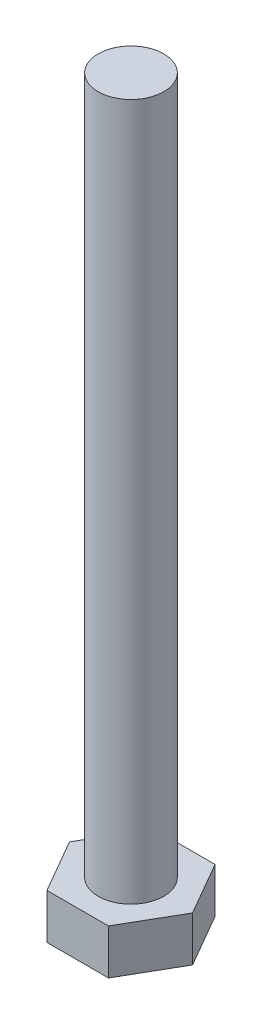
ISO-10303-21;
HEADER;
FILE_DESCRIPTION(('STEP AP214'),'2;1');
FILE_NAME('part.step','',(''),(''),'','','');
FILE_SCHEMA(('AUTOMOTIVE_DESIGN { 1 0 10303 214 1 1 1 1 }'));
ENDSEC;
DATA;
#1=APPLICATION_CONTEXT('core data for automotive mechanical design processes');
#2=APPLICATION_PROTOCOL_DEFINITION('international standard','automotive_design',2000,#1);
#3=PRODUCT_CONTEXT('',#1,'mechanical');
#4=PRODUCT('Part','Part','',(#3));
#5=PRODUCT_RELATED_PRODUCT_CATEGORY('part','',(#4));
#6=PRODUCT_DEFINITION_FORMATION('','',#4);
#7=PRODUCT_DEFINITION_CONTEXT('part definition',#1,'design');
#8=PRODUCT_DEFINITION('design','',#6,#7);
#9=PRODUCT_DEFINITION_SHAPE('','',#8);
#10=(LENGTH_UNIT() NAMED_UNIT(*) SI_UNIT(.MILLI.,.METRE.));
#11=(NAMED_UNIT(*) PLANE_ANGLE_UNIT() SI_UNIT($,.RADIAN.));
#12=(NAMED_UNIT(*) SI_UNIT($,.STERADIAN.) SOLID_ANGLE_UNIT());
#13=UNCERTAINTY_MEASURE_WITH_UNIT(LENGTH_MEASURE(1.E-05),#10,'distance_accuracy_value','');
#14=(GEOMETRIC_REPRESENTATION_CONTEXT(3) GLOBAL_UNCERTAINTY_ASSIGNED_CONTEXT((#13)) GLOBAL_UNIT_ASSIGNED_CONTEXT((#10,
#11,#12)) REPRESENTATION_CONTEXT('',''));
#15=CARTESIAN_POINT('',(0.,0.,0.));
#16=DIRECTION('',(0.,0.,1.));
#17=DIRECTION('',(1.,0.,0.));
#18=AXIS2_PLACEMENT_3D('',#15,#16,#17);
#19=CARTESIAN_POINT('',(0.,5.5,0.));
#20=DIRECTION('',(0.,1.,0.));
#21=DIRECTION('',(0.,0.,1.));
#22=AXIS2_PLACEMENT_3D('',#19,#20,#21);
#23=PLANE('',#22);
#24=DIRECTION('',(-0.5,0.,0.866025403784439));
#25=VECTOR('',#24,1.);
#26=CARTESIAN_POINT('',(-3.75277674973257,5.5,-6.5));
#27=LINE('',#26,#25);
#28=CARTESIAN_POINT('',(-3.75277674973257,5.5,-6.5));
#29=VERTEX_POINT('',#28);
#30=CARTESIAN_POINT('',(-7.50555349946514,5.5,0.));
#31=VERTEX_POINT('',#30);
#32=EDGE_CURVE('E128',#29,#31,#27,.T.);
#33=ORIENTED_EDGE('',*,*,#32,.T.);
#34=DIRECTION('',(0.5,0.,0.866025403784439));
#35=VECTOR('',#34,1.);
#36=CARTESIAN_POINT('',(-7.50555349946514,5.5,0.));
#37=LINE('',#36,#35);
#38=CARTESIAN_POINT('',(-3.75277674973257,5.5,6.5));
#39=VERTEX_POINT('',#38);
#40=EDGE_CURVE('E86',#31,#39,#37,.T.);
#41=ORIENTED_EDGE('',*,*,#40,.T.);
#42=DIRECTION('',(1.,0.,0.));
#43=VECTOR('',#42,1.);
#44=CARTESIAN_POINT('',(-3.75277674973257,5.5,6.5));
#45=LINE('',#44,#43);
#46=CARTESIAN_POINT('',(3.75277674973257,5.5,6.5));
#47=VERTEX_POINT('',#46);
#48=EDGE_CURVE('E99',#39,#47,#45,.T.);
#49=ORIENTED_EDGE('',*,*,#48,.T.);
#50=DIRECTION('',(0.5,0.,-0.866025403784439));
#51=VECTOR('',#50,1.);
#52=CARTESIAN_POINT('',(3.75277674973257,5.5,6.5));
#53=LINE('',#52,#51);
#54=CARTESIAN_POINT('',(7.50555349946513,5.5,0.));
#55=VERTEX_POINT('',#54);
#56=EDGE_CURVE('E93',#47,#55,#53,.T.);
#57=ORIENTED_EDGE('',*,*,#56,.T.);
#58=DIRECTION('',(-0.5,0.,-0.866025403784439));
#59=VECTOR('',#58,1.);
#60=CARTESIAN_POINT('',(7.50555349946513,5.5,0.));
#61=LINE('',#60,#59);
#62=CARTESIAN_POINT('',(3.75277674973257,5.5,-6.5));
#63=VERTEX_POINT('',#62);
#64=EDGE_CURVE('E97',#55,#63,#61,.T.);
#65=ORIENTED_EDGE('',*,*,#64,.T.);
#66=DIRECTION('',(-1.,0.,0.));
#67=VECTOR('',#66,1.);
#68=CARTESIAN_POINT('',(3.75277674973257,5.5,-6.5));
#69=LINE('',#68,#67);
#70=EDGE_CURVE('E49',#63,#29,#69,.T.);
#71=ORIENTED_EDGE('',*,*,#70,.T.);
#72=EDGE_LOOP('',(#33,#41,#49,#57,#65,#71));
#73=FACE_BOUND('',#72,.T.);
#74=CARTESIAN_POINT('',(0.,5.5,0.));
#75=DIRECTION('',(0.,1.,0.));
#76=DIRECTION('',(0.,0.,1.));
#77=AXIS2_PLACEMENT_3D('',#74,#75,#76);
#78=CIRCLE('',#77,4.);
#79=CARTESIAN_POINT('',(0.,5.5,4.));
#80=VERTEX_POINT('',#79);
#81=EDGE_CURVE('E168',#80,#80,#78,.T.);
#82=ORIENTED_EDGE('',*,*,#81,.F.);
#83=EDGE_LOOP('',(#82));
#84=FACE_BOUND('',#83,.T.);
#85=ADVANCED_FACE('F32',(#73,#84),#23,.T.);
#86=CARTESIAN_POINT('',(-3.75277674973257,5.5,-6.5));
#87=DIRECTION('',(0.866025403784439,0.,0.5));
#88=DIRECTION('',(0.5,0.,-0.866025403784438));
#89=AXIS2_PLACEMENT_3D('',#86,#87,#88);
#90=PLANE('',#89);
#91=DIRECTION('',(-0.5,0.,0.866025403784439));
#92=VECTOR('',#91,1.);
#93=CARTESIAN_POINT('',(-3.75277674973257,0.,-6.5));
#94=LINE('',#93,#92);
#95=CARTESIAN_POINT('',(-3.75277674973257,0.,-6.5));
#96=VERTEX_POINT('',#95);
#97=CARTESIAN_POINT('',(-7.50555349946514,0.,0.));
#98=VERTEX_POINT('',#97);
#99=EDGE_CURVE('E117',#96,#98,#94,.T.);
#100=ORIENTED_EDGE('',*,*,#99,.T.);
#101=DIRECTION('',(0.,-1.,0.));
#102=VECTOR('',#101,1.);
#103=CARTESIAN_POINT('',(-7.50555349946514,5.5,0.));
#104=LINE('',#103,#102);
#105=EDGE_CURVE('E11',#31,#98,#104,.T.);
#106=ORIENTED_EDGE('',*,*,#105,.F.);
#107=ORIENTED_EDGE('',*,*,#32,.F.);
#108=DIRECTION('',(0.,-1.,0.));
#109=VECTOR('',#108,1.);
#110=CARTESIAN_POINT('',(-3.75277674973257,5.5,-6.5));
#111=LINE('',#110,#109);
#112=EDGE_CURVE('E113',#29,#96,#111,.T.);
#113=ORIENTED_EDGE('',*,*,#112,.T.);
#114=EDGE_LOOP('',(#100,#106,#107,#113));
#115=FACE_BOUND('',#114,.T.);
#116=ADVANCED_FACE('F34',(#115),#90,.F.);
#117=CARTESIAN_POINT('',(-7.50555349946514,5.5,0.));
#118=DIRECTION('',(0.866025403784439,0.,-0.5));
#119=DIRECTION('',(-0.5,0.,-0.866025403784439));
#120=AXIS2_PLACEMENT_3D('',#117,#118,#119);
#121=PLANE('',#120);
#122=DIRECTION('',(0.5,0.,0.866025403784439));
#123=VECTOR('',#122,1.);
#124=CARTESIAN_POINT('',(-7.50555349946514,0.,0.));
#125=LINE('',#124,#123);
#126=CARTESIAN_POINT('',(-3.75277674973257,0.,6.5));
#127=VERTEX_POINT('',#126);
#128=EDGE_CURVE('E120',#98,#127,#125,.T.);
#129=ORIENTED_EDGE('',*,*,#128,.T.);
#130=DIRECTION('',(0.,-1.,0.));
#131=VECTOR('',#130,1.);
#132=CARTESIAN_POINT('',(-3.75277674973257,5.5,6.5));
#133=LINE('',#132,#131);
#134=EDGE_CURVE('E41',#39,#127,#133,.T.);
#135=ORIENTED_EDGE('',*,*,#134,.F.);
#136=ORIENTED_EDGE('',*,*,#40,.F.);
#137=ORIENTED_EDGE('',*,*,#105,.T.);
#138=EDGE_LOOP('',(#129,#135,#136,#137));
#139=FACE_BOUND('',#138,.T.);
#140=ADVANCED_FACE('F156',(#139),#121,.F.);
#141=CARTESIAN_POINT('',(-3.75277674973257,5.5,6.5));
#142=DIRECTION('',(0.,0.,-1.));
#143=DIRECTION('',(-1.,0.,0.));
#144=AXIS2_PLACEMENT_3D('',#141,#142,#143);
#145=PLANE('',#144);
#146=DIRECTION('',(1.,0.,0.));
#147=VECTOR('',#146,1.);
#148=CARTESIAN_POINT('',(-3.75277674973257,0.,6.5));
#149=LINE('',#148,#147);
#150=CARTESIAN_POINT('',(3.75277674973257,0.,6.5));
#151=VERTEX_POINT('',#150);
#152=EDGE_CURVE('E123',#127,#151,#149,.T.);
#153=ORIENTED_EDGE('',*,*,#152,.T.);
#154=DIRECTION('',(0.,-1.,0.));
#155=VECTOR('',#154,1.);
#156=CARTESIAN_POINT('',(3.75277674973257,5.5,6.5));
#157=LINE('',#156,#155);
#158=EDGE_CURVE('E108',#47,#151,#157,.T.);
#159=ORIENTED_EDGE('',*,*,#158,.F.);
#160=ORIENTED_EDGE('',*,*,#48,.F.);
#161=ORIENTED_EDGE('',*,*,#134,.T.);
#162=EDGE_LOOP('',(#153,#159,#160,#161));
#163=FACE_BOUND('',#162,.T.);
#164=ADVANCED_FACE('F134',(#163),#145,.F.);
#165=CARTESIAN_POINT('',(3.75277674973257,5.5,6.5));
#166=DIRECTION('',(-0.866025403784439,0.,-0.5));
#167=DIRECTION('',(-0.5,0.,0.866025403784439));
#168=AXIS2_PLACEMENT_3D('',#165,#166,#167);
#169=PLANE('',#168);
#170=DIRECTION('',(0.5,0.,-0.866025403784439));
#171=VECTOR('',#170,1.);
#172=CARTESIAN_POINT('',(3.75277674973257,0.,6.5));
#173=LINE('',#172,#171);
#174=CARTESIAN_POINT('',(7.50555349946513,0.,0.));
#175=VERTEX_POINT('',#174);
#176=EDGE_CURVE('E107',#151,#175,#173,.T.);
#177=ORIENTED_EDGE('',*,*,#176,.T.);
#178=DIRECTION('',(0.,-1.,0.));
#179=VECTOR('',#178,1.);
#180=CARTESIAN_POINT('',(7.50555349946513,5.5,0.));
#181=LINE('',#180,#179);
#182=EDGE_CURVE('E104',#55,#175,#181,.T.);
#183=ORIENTED_EDGE('',*,*,#182,.F.);
#184=ORIENTED_EDGE('',*,*,#56,.F.);
#185=ORIENTED_EDGE('',*,*,#158,.T.);
#186=EDGE_LOOP('',(#177,#183,#184,#185));
#187=FACE_BOUND('',#186,.T.);
#188=ADVANCED_FACE('F105',(#187),#169,.F.);
#189=CARTESIAN_POINT('',(7.50555349946513,5.5,0.));
#190=DIRECTION('',(-0.866025403784439,0.,0.5));
#191=DIRECTION('',(0.5,0.,0.866025403784439));
#192=AXIS2_PLACEMENT_3D('',#189,#190,#191);
#193=PLANE('',#192);
#194=DIRECTION('',(-0.5,0.,-0.866025403784439));
#195=VECTOR('',#194,1.);
#196=CARTESIAN_POINT('',(7.50555349946513,0.,0.));
#197=LINE('',#196,#195);
#198=CARTESIAN_POINT('',(3.75277674973257,0.,-6.5));
#199=VERTEX_POINT('',#198);
#200=EDGE_CURVE('E72',#175,#199,#197,.T.);
#201=ORIENTED_EDGE('',*,*,#200,.T.);
#202=DIRECTION('',(0.,-1.,0.));
#203=VECTOR('',#202,1.);
#204=CARTESIAN_POINT('',(3.75277674973257,5.5,-6.5));
#205=LINE('',#204,#203);
#206=EDGE_CURVE('E109',#63,#199,#205,.T.);
#207=ORIENTED_EDGE('',*,*,#206,.F.);
#208=ORIENTED_EDGE('',*,*,#64,.F.);
#209=ORIENTED_EDGE('',*,*,#182,.T.);
#210=EDGE_LOOP('',(#201,#207,#208,#209));
#211=FACE_BOUND('',#210,.T.);
#212=ADVANCED_FACE('F111',(#211),#193,.F.);
#213=CARTESIAN_POINT('',(3.75277674973257,5.5,-6.5));
#214=DIRECTION('',(0.,0.,1.));
#215=DIRECTION('',(1.,0.,0.));
#216=AXIS2_PLACEMENT_3D('',#213,#214,#215);
#217=PLANE('',#216);
#218=DIRECTION('',(-1.,0.,0.));
#219=VECTOR('',#218,1.);
#220=CARTESIAN_POINT('',(3.75277674973257,0.,-6.5));
#221=LINE('',#220,#219);
#222=EDGE_CURVE('E78',#199,#96,#221,.T.);
#223=ORIENTED_EDGE('',*,*,#222,.T.);
#224=ORIENTED_EDGE('',*,*,#112,.F.);
#225=ORIENTED_EDGE('',*,*,#70,.F.);
#226=ORIENTED_EDGE('',*,*,#206,.T.);
#227=EDGE_LOOP('',(#223,#224,#225,#226));
#228=FACE_BOUND('',#227,.T.);
#229=ADVANCED_FACE('F141',(#228),#217,.F.);
#230=CARTESIAN_POINT('',(0.,0.,0.));
#231=DIRECTION('',(0.,1.,0.));
#232=DIRECTION('',(0.,0.,1.));
#233=AXIS2_PLACEMENT_3D('',#230,#231,#232);
#234=PLANE('',#233);
#235=ORIENTED_EDGE('',*,*,#99,.F.);
#236=ORIENTED_EDGE('',*,*,#222,.F.);
#237=ORIENTED_EDGE('',*,*,#200,.F.);
#238=ORIENTED_EDGE('',*,*,#176,.F.);
#239=ORIENTED_EDGE('',*,*,#152,.F.);
#240=ORIENTED_EDGE('',*,*,#128,.F.);
#241=EDGE_LOOP('',(#235,#236,#237,#238,#239,#240));
#242=FACE_BOUND('',#241,.T.);
#243=ADVANCED_FACE('F137',(#242),#234,.F.);
#244=CARTESIAN_POINT('',(0.,90.5,0.));
#245=DIRECTION('',(0.,-1.,0.));
#246=DIRECTION('',(0.,0.,-1.));
#247=AXIS2_PLACEMENT_3D('',#244,#245,#246);
#248=CYLINDRICAL_SURFACE('',#247,4.);
#249=CARTESIAN_POINT('',(0.,90.5,0.));
#250=DIRECTION('',(0.,1.,0.));
#251=DIRECTION('',(0.,0.,1.));
#252=AXIS2_PLACEMENT_3D('',#249,#250,#251);
#253=CIRCLE('',#252,4.);
#254=CARTESIAN_POINT('',(0.,90.5,4.));
#255=VERTEX_POINT('',#254);
#256=EDGE_CURVE('E121',#255,#255,#253,.T.);
#257=ORIENTED_EDGE('',*,*,#256,.F.);
#258=EDGE_LOOP('',(#257));
#259=FACE_BOUND('',#258,.T.);
#260=ORIENTED_EDGE('',*,*,#81,.T.);
#261=EDGE_LOOP('',(#260));
#262=FACE_BOUND('',#261,.T.);
#263=ADVANCED_FACE('F148',(#259,#262),#248,.T.);
#264=CARTESIAN_POINT('',(0.,90.5,0.));
#265=DIRECTION('',(0.,1.,0.));
#266=DIRECTION('',(0.,0.,1.));
#267=AXIS2_PLACEMENT_3D('',#264,#265,#266);
#268=PLANE('',#267);
#269=ORIENTED_EDGE('',*,*,#256,.T.);
#270=EDGE_LOOP('',(#269));
#271=FACE_BOUND('',#270,.T.);
#272=ADVANCED_FACE('F160',(#271),#268,.T.);
#273=CLOSED_SHELL('',(#85,#116,#140,#164,#188,#212,#229,#243,#263,#272));
#274=MANIFOLD_SOLID_BREP('B2',#273);
#275=ADVANCED_BREP_SHAPE_REPRESENTATION('',(#18,#274),#14);
#276=SHAPE_DEFINITION_REPRESENTATION(#9,#275);
ENDSEC;
END-ISO-10303-21;
